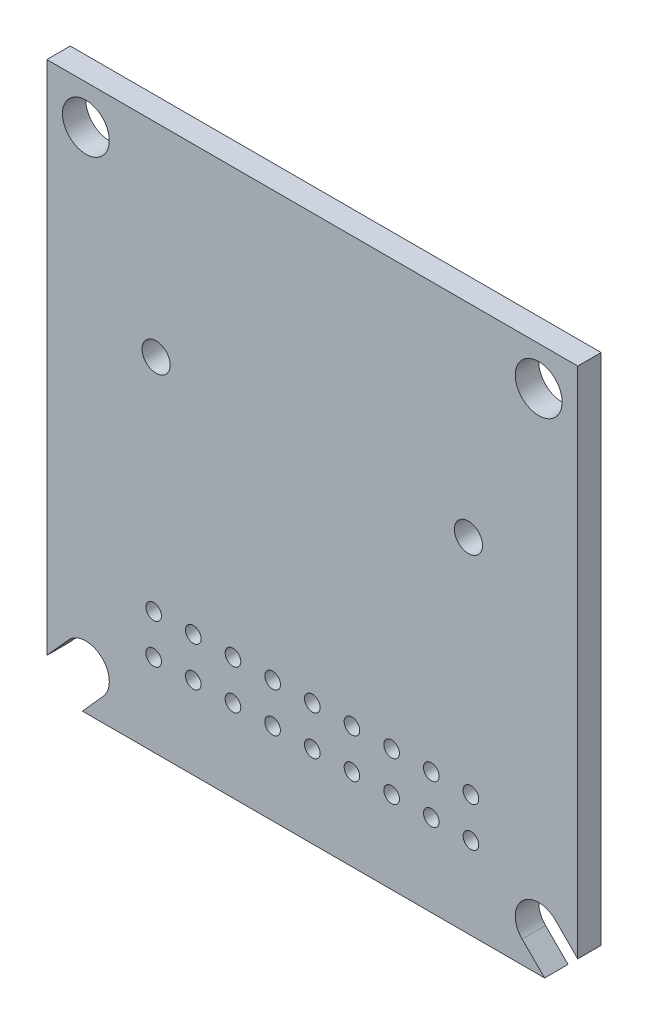
ISO-10303-21;
HEADER;
FILE_DESCRIPTION(('STEP AP214'),'2;1');
FILE_NAME('part.step','',(''),(''),'','','');
FILE_SCHEMA(('AUTOMOTIVE_DESIGN { 1 0 10303 214 1 1 1 1 }'));
ENDSEC;
DATA;
#1=APPLICATION_CONTEXT('core data for automotive mechanical design processes');
#2=APPLICATION_PROTOCOL_DEFINITION('international standard','automotive_design',2000,#1);
#3=PRODUCT_CONTEXT('',#1,'mechanical');
#4=PRODUCT('Part','Part','',(#3));
#5=PRODUCT_RELATED_PRODUCT_CATEGORY('part','',(#4));
#6=PRODUCT_DEFINITION_FORMATION('','',#4);
#7=PRODUCT_DEFINITION_CONTEXT('part definition',#1,'design');
#8=PRODUCT_DEFINITION('design','',#6,#7);
#9=PRODUCT_DEFINITION_SHAPE('','',#8);
#10=(LENGTH_UNIT() NAMED_UNIT(*) SI_UNIT(.MILLI.,.METRE.));
#11=(NAMED_UNIT(*) PLANE_ANGLE_UNIT() SI_UNIT($,.RADIAN.));
#12=(NAMED_UNIT(*) SI_UNIT($,.STERADIAN.) SOLID_ANGLE_UNIT());
#13=UNCERTAINTY_MEASURE_WITH_UNIT(LENGTH_MEASURE(1.E-05),#10,'distance_accuracy_value','');
#14=(GEOMETRIC_REPRESENTATION_CONTEXT(3) GLOBAL_UNCERTAINTY_ASSIGNED_CONTEXT((#13)) GLOBAL_UNIT_ASSIGNED_CONTEXT((#10,
#11,#12)) REPRESENTATION_CONTEXT('',''));
#15=CARTESIAN_POINT('',(0.,0.,0.));
#16=DIRECTION('',(0.,0.,1.));
#17=DIRECTION('',(1.,0.,0.));
#18=AXIS2_PLACEMENT_3D('',#15,#16,#17);
#19=CARTESIAN_POINT('',(0.,0.,0.));
#20=DIRECTION('',(0.,0.,1.));
#21=DIRECTION('',(1.,0.,0.));
#22=AXIS2_PLACEMENT_3D('',#19,#20,#21);
#23=PLANE('',#22);
#24=CARTESIAN_POINT('',(14.5,15.,0.));
#25=DIRECTION('',(0.,0.,-1.));
#26=DIRECTION('',(-1.,0.,0.));
#27=AXIS2_PLACEMENT_3D('',#24,#25,#26);
#28=CIRCLE('',#27,1.5);
#29=CARTESIAN_POINT('',(13.,15.,0.));
#30=VERTEX_POINT('',#29);
#31=EDGE_CURVE('E234',#30,#30,#28,.F.);
#32=ORIENTED_EDGE('',*,*,#31,.T.);
#33=EDGE_LOOP('',(#32));
#34=FACE_BOUND('',#33,.T.);
#35=CARTESIAN_POINT('',(-14.5,15.,0.));
#36=DIRECTION('',(0.,0.,-1.));
#37=DIRECTION('',(-1.,0.,0.));
#38=AXIS2_PLACEMENT_3D('',#35,#36,#37);
#39=CIRCLE('',#38,1.5);
#40=CARTESIAN_POINT('',(-16.,15.,0.));
#41=VERTEX_POINT('',#40);
#42=EDGE_CURVE('E242',#41,#41,#39,.F.);
#43=ORIENTED_EDGE('',*,*,#42,.T.);
#44=EDGE_LOOP('',(#43));
#45=FACE_BOUND('',#44,.T.);
#46=CARTESIAN_POINT('',(10.,4.5,0.));
#47=DIRECTION('',(0.,0.,-1.));
#48=DIRECTION('',(-1.,0.,0.));
#49=AXIS2_PLACEMENT_3D('',#46,#47,#48);
#50=CIRCLE('',#49,0.9);
#51=CARTESIAN_POINT('',(9.1,4.5,0.));
#52=VERTEX_POINT('',#51);
#53=EDGE_CURVE('E251',#52,#52,#50,.F.);
#54=ORIENTED_EDGE('',*,*,#53,.T.);
#55=EDGE_LOOP('',(#54));
#56=FACE_BOUND('',#55,.T.);
#57=CARTESIAN_POINT('',(0.,-12.23,0.));
#58=DIRECTION('',(0.,0.,-1.));
#59=DIRECTION('',(-1.,0.,0.));
#60=AXIS2_PLACEMENT_3D('',#57,#58,#59);
#61=CIRCLE('',#60,0.500000000000001);
#62=CARTESIAN_POINT('',(-0.500000000000004,-12.23,0.));
#63=VERTEX_POINT('',#62);
#64=EDGE_CURVE('E255',#63,#63,#61,.F.);
#65=ORIENTED_EDGE('',*,*,#64,.T.);
#66=EDGE_LOOP('',(#65));
#67=FACE_BOUND('',#66,.T.);
#68=CARTESIAN_POINT('',(0.,-9.69000000000001,0.));
#69=DIRECTION('',(0.,0.,-1.));
#70=DIRECTION('',(-1.,0.,0.));
#71=AXIS2_PLACEMENT_3D('',#68,#69,#70);
#72=CIRCLE('',#71,0.500000000000001);
#73=CARTESIAN_POINT('',(-0.500000000000004,-9.69000000000001,0.));
#74=VERTEX_POINT('',#73);
#75=EDGE_CURVE('E259',#74,#74,#72,.F.);
#76=ORIENTED_EDGE('',*,*,#75,.T.);
#77=EDGE_LOOP('',(#76));
#78=FACE_BOUND('',#77,.T.);
#79=CARTESIAN_POINT('',(5.08,-12.23,0.));
#80=DIRECTION('',(0.,0.,-1.));
#81=DIRECTION('',(-1.,0.,0.));
#82=AXIS2_PLACEMENT_3D('',#79,#80,#81);
#83=CIRCLE('',#82,0.5);
#84=CARTESIAN_POINT('',(4.58,-12.23,0.));
#85=VERTEX_POINT('',#84);
#86=EDGE_CURVE('E263',#85,#85,#83,.F.);
#87=ORIENTED_EDGE('',*,*,#86,.T.);
#88=EDGE_LOOP('',(#87));
#89=FACE_BOUND('',#88,.T.);
#90=CARTESIAN_POINT('',(2.54,-9.69000000000001,0.));
#91=DIRECTION('',(0.,0.,-1.));
#92=DIRECTION('',(-1.,0.,0.));
#93=AXIS2_PLACEMENT_3D('',#90,#91,#92);
#94=CIRCLE('',#93,0.500000000000001);
#95=CARTESIAN_POINT('',(2.04,-9.69000000000001,0.));
#96=VERTEX_POINT('',#95);
#97=EDGE_CURVE('E267',#96,#96,#94,.F.);
#98=ORIENTED_EDGE('',*,*,#97,.T.);
#99=EDGE_LOOP('',(#98));
#100=FACE_BOUND('',#99,.T.);
#101=CARTESIAN_POINT('',(2.54,-12.23,0.));
#102=DIRECTION('',(0.,0.,-1.));
#103=DIRECTION('',(-1.,0.,0.));
#104=AXIS2_PLACEMENT_3D('',#101,#102,#103);
#105=CIRCLE('',#104,0.500000000000001);
#106=CARTESIAN_POINT('',(2.04,-12.23,0.));
#107=VERTEX_POINT('',#106);
#108=EDGE_CURVE('E271',#107,#107,#105,.F.);
#109=ORIENTED_EDGE('',*,*,#108,.T.);
#110=EDGE_LOOP('',(#109));
#111=FACE_BOUND('',#110,.T.);
#112=CARTESIAN_POINT('',(10.16,-9.69000000000001,0.));
#113=DIRECTION('',(0.,0.,-1.));
#114=DIRECTION('',(-1.,0.,0.));
#115=AXIS2_PLACEMENT_3D('',#112,#113,#114);
#116=CIRCLE('',#115,0.5);
#117=CARTESIAN_POINT('',(9.66,-9.69000000000001,0.));
#118=VERTEX_POINT('',#117);
#119=EDGE_CURVE('E275',#118,#118,#116,.F.);
#120=ORIENTED_EDGE('',*,*,#119,.T.);
#121=EDGE_LOOP('',(#120));
#122=FACE_BOUND('',#121,.T.);
#123=CARTESIAN_POINT('',(10.16,-12.23,0.));
#124=DIRECTION('',(0.,0.,-1.));
#125=DIRECTION('',(-1.,0.,0.));
#126=AXIS2_PLACEMENT_3D('',#123,#124,#125);
#127=CIRCLE('',#126,0.5);
#128=CARTESIAN_POINT('',(9.66,-12.23,0.));
#129=VERTEX_POINT('',#128);
#130=EDGE_CURVE('E279',#129,#129,#127,.F.);
#131=ORIENTED_EDGE('',*,*,#130,.T.);
#132=EDGE_LOOP('',(#131));
#133=FACE_BOUND('',#132,.T.);
#134=CARTESIAN_POINT('',(7.62,-9.69000000000001,0.));
#135=DIRECTION('',(0.,0.,-1.));
#136=DIRECTION('',(-1.,0.,0.));
#137=AXIS2_PLACEMENT_3D('',#134,#135,#136);
#138=CIRCLE('',#137,0.5);
#139=CARTESIAN_POINT('',(7.12,-9.69000000000001,0.));
#140=VERTEX_POINT('',#139);
#141=EDGE_CURVE('E283',#140,#140,#138,.F.);
#142=ORIENTED_EDGE('',*,*,#141,.T.);
#143=EDGE_LOOP('',(#142));
#144=FACE_BOUND('',#143,.T.);
#145=CARTESIAN_POINT('',(7.62,-12.23,0.));
#146=DIRECTION('',(0.,0.,-1.));
#147=DIRECTION('',(-1.,0.,0.));
#148=AXIS2_PLACEMENT_3D('',#145,#146,#147);
#149=CIRCLE('',#148,0.5);
#150=CARTESIAN_POINT('',(7.12,-12.23,0.));
#151=VERTEX_POINT('',#150);
#152=EDGE_CURVE('E287',#151,#151,#149,.F.);
#153=ORIENTED_EDGE('',*,*,#152,.T.);
#154=EDGE_LOOP('',(#153));
#155=FACE_BOUND('',#154,.T.);
#156=CARTESIAN_POINT('',(5.08,-9.69000000000001,0.));
#157=DIRECTION('',(0.,0.,-1.));
#158=DIRECTION('',(-1.,0.,0.));
#159=AXIS2_PLACEMENT_3D('',#156,#157,#158);
#160=CIRCLE('',#159,0.5);
#161=CARTESIAN_POINT('',(4.58,-9.69000000000001,0.));
#162=VERTEX_POINT('',#161);
#163=EDGE_CURVE('E291',#162,#162,#160,.F.);
#164=ORIENTED_EDGE('',*,*,#163,.T.);
#165=EDGE_LOOP('',(#164));
#166=FACE_BOUND('',#165,.T.);
#167=CARTESIAN_POINT('',(-7.62,-12.23,0.));
#168=DIRECTION('',(0.,0.,-1.));
#169=DIRECTION('',(-1.,0.,0.));
#170=AXIS2_PLACEMENT_3D('',#167,#168,#169);
#171=CIRCLE('',#170,0.5);
#172=CARTESIAN_POINT('',(-8.12,-12.23,0.));
#173=VERTEX_POINT('',#172);
#174=EDGE_CURVE('E295',#173,#173,#171,.F.);
#175=ORIENTED_EDGE('',*,*,#174,.T.);
#176=EDGE_LOOP('',(#175));
#177=FACE_BOUND('',#176,.T.);
#178=CARTESIAN_POINT('',(-10.16,-9.69000000000001,0.));
#179=DIRECTION('',(0.,0.,-1.));
#180=DIRECTION('',(-1.,0.,0.));
#181=AXIS2_PLACEMENT_3D('',#178,#179,#180);
#182=CIRCLE('',#181,0.5);
#183=CARTESIAN_POINT('',(-10.66,-9.69000000000001,0.));
#184=VERTEX_POINT('',#183);
#185=EDGE_CURVE('E299',#184,#184,#182,.F.);
#186=ORIENTED_EDGE('',*,*,#185,.T.);
#187=EDGE_LOOP('',(#186));
#188=FACE_BOUND('',#187,.T.);
#189=CARTESIAN_POINT('',(-10.16,-12.23,0.));
#190=DIRECTION('',(0.,0.,-1.));
#191=DIRECTION('',(-1.,0.,0.));
#192=AXIS2_PLACEMENT_3D('',#189,#190,#191);
#193=CIRCLE('',#192,0.5);
#194=CARTESIAN_POINT('',(-10.66,-12.23,0.));
#195=VERTEX_POINT('',#194);
#196=EDGE_CURVE('E303',#195,#195,#193,.F.);
#197=ORIENTED_EDGE('',*,*,#196,.T.);
#198=EDGE_LOOP('',(#197));
#199=FACE_BOUND('',#198,.T.);
#200=CARTESIAN_POINT('',(-10.,4.5,0.));
#201=DIRECTION('',(0.,0.,-1.));
#202=DIRECTION('',(-1.,0.,0.));
#203=AXIS2_PLACEMENT_3D('',#200,#201,#202);
#204=CIRCLE('',#203,0.9);
#205=CARTESIAN_POINT('',(-10.9,4.5,0.));
#206=VERTEX_POINT('',#205);
#207=EDGE_CURVE('E307',#206,#206,#204,.F.);
#208=ORIENTED_EDGE('',*,*,#207,.T.);
#209=EDGE_LOOP('',(#208));
#210=FACE_BOUND('',#209,.T.);
#211=CARTESIAN_POINT('',(-2.54,-9.69000000000001,0.));
#212=DIRECTION('',(0.,0.,-1.));
#213=DIRECTION('',(-1.,0.,0.));
#214=AXIS2_PLACEMENT_3D('',#211,#212,#213);
#215=CIRCLE('',#214,0.500000000000001);
#216=CARTESIAN_POINT('',(-3.04,-9.69000000000001,0.));
#217=VERTEX_POINT('',#216);
#218=EDGE_CURVE('E311',#217,#217,#215,.F.);
#219=ORIENTED_EDGE('',*,*,#218,.T.);
#220=EDGE_LOOP('',(#219));
#221=FACE_BOUND('',#220,.T.);
#222=CARTESIAN_POINT('',(-2.54,-12.23,0.));
#223=DIRECTION('',(0.,0.,-1.));
#224=DIRECTION('',(-1.,0.,0.));
#225=AXIS2_PLACEMENT_3D('',#222,#223,#224);
#226=CIRCLE('',#225,0.500000000000001);
#227=CARTESIAN_POINT('',(-3.04,-12.23,0.));
#228=VERTEX_POINT('',#227);
#229=EDGE_CURVE('E315',#228,#228,#226,.F.);
#230=ORIENTED_EDGE('',*,*,#229,.T.);
#231=EDGE_LOOP('',(#230));
#232=FACE_BOUND('',#231,.T.);
#233=CARTESIAN_POINT('',(-5.08,-9.69000000000001,0.));
#234=DIRECTION('',(0.,0.,-1.));
#235=DIRECTION('',(-1.,0.,0.));
#236=AXIS2_PLACEMENT_3D('',#233,#234,#235);
#237=CIRCLE('',#236,0.500000000000001);
#238=CARTESIAN_POINT('',(-5.58000000000001,-9.69000000000001,0.));
#239=VERTEX_POINT('',#238);
#240=EDGE_CURVE('E319',#239,#239,#237,.F.);
#241=ORIENTED_EDGE('',*,*,#240,.T.);
#242=EDGE_LOOP('',(#241));
#243=FACE_BOUND('',#242,.T.);
#244=CARTESIAN_POINT('',(-5.08,-12.23,0.));
#245=DIRECTION('',(0.,0.,-1.));
#246=DIRECTION('',(-1.,0.,0.));
#247=AXIS2_PLACEMENT_3D('',#244,#245,#246);
#248=CIRCLE('',#247,0.500000000000001);
#249=CARTESIAN_POINT('',(-5.58000000000001,-12.23,0.));
#250=VERTEX_POINT('',#249);
#251=EDGE_CURVE('E323',#250,#250,#248,.F.);
#252=ORIENTED_EDGE('',*,*,#251,.T.);
#253=EDGE_LOOP('',(#252));
#254=FACE_BOUND('',#253,.T.);
#255=CARTESIAN_POINT('',(-7.62,-9.69000000000001,0.));
#256=DIRECTION('',(0.,0.,-1.));
#257=DIRECTION('',(-1.,0.,0.));
#258=AXIS2_PLACEMENT_3D('',#255,#256,#257);
#259=CIRCLE('',#258,0.5);
#260=CARTESIAN_POINT('',(-8.12,-9.69000000000001,0.));
#261=VERTEX_POINT('',#260);
#262=EDGE_CURVE('E327',#261,#261,#259,.F.);
#263=ORIENTED_EDGE('',*,*,#262,.T.);
#264=EDGE_LOOP('',(#263));
#265=FACE_BOUND('',#264,.T.);
#266=DIRECTION('',(-0.666000580325846,-0.74595122293997,0.));
#267=VECTOR('',#266,1.);
#268=CARTESIAN_POINT('',(0.502559253420135,-0.448695228498699,0.));
#269=LINE('',#268,#267);
#270=CARTESIAN_POINT('',(-13.38107316559,-15.9990008704888,0.));
#271=VERTEX_POINT('',#270);
#272=CARTESIAN_POINT('',(-14.7211960323147,-17.5,0.));
#273=VERTEX_POINT('',#272);
#274=EDGE_CURVE('E416',#271,#273,#269,.T.);
#275=ORIENTED_EDGE('',*,*,#274,.F.);
#276=CARTESIAN_POINT('',(-14.5,-15.,0.));
#277=DIRECTION('',(0.,0.,-1.));
#278=DIRECTION('',(-1.,0.,0.));
#279=AXIS2_PLACEMENT_3D('',#276,#277,#278);
#280=CIRCLE('',#279,1.5);
#281=CARTESIAN_POINT('',(-15.61892683441,-14.0009991295112,0.));
#282=VERTEX_POINT('',#281);
#283=EDGE_CURVE('E238',#271,#282,#280,.F.);
#284=ORIENTED_EDGE('',*,*,#283,.T.);
#285=DIRECTION('',(-0.666000580325846,-0.74595122293997,0.));
#286=VECTOR('',#285,1.);
#287=CARTESIAN_POINT('',(-1.73529441539978,1.54930651247884,0.));
#288=LINE('',#287,#286);
#289=CARTESIAN_POINT('',(-17.,-15.5478644735886,0.));
#290=VERTEX_POINT('',#289);
#291=EDGE_CURVE('E55',#282,#290,#288,.T.);
#292=ORIENTED_EDGE('',*,*,#291,.T.);
#293=DIRECTION('',(0.,1.,0.));
#294=VECTOR('',#293,1.);
#295=CARTESIAN_POINT('',(-17.,-17.5,0.));
#296=LINE('',#295,#294);
#297=CARTESIAN_POINT('',(-17.,17.5,0.));
#298=VERTEX_POINT('',#297);
#299=EDGE_CURVE('E246',#290,#298,#296,.T.);
#300=ORIENTED_EDGE('',*,*,#299,.T.);
#301=DIRECTION('',(1.,0.,0.));
#302=VECTOR('',#301,1.);
#303=CARTESIAN_POINT('',(17.,17.5,0.));
#304=LINE('',#303,#302);
#305=CARTESIAN_POINT('',(17.,17.5,0.));
#306=VERTEX_POINT('',#305);
#307=EDGE_CURVE('E241',#298,#306,#304,.T.);
#308=ORIENTED_EDGE('',*,*,#307,.T.);
#309=DIRECTION('',(0.,1.,0.));
#310=VECTOR('',#309,1.);
#311=CARTESIAN_POINT('',(17.,-17.5,0.));
#312=LINE('',#311,#310);
#313=CARTESIAN_POINT('',(17.,-15.3786796564404,0.));
#314=VERTEX_POINT('',#313);
#315=EDGE_CURVE('E364',#306,#314,#312,.F.);
#316=ORIENTED_EDGE('',*,*,#315,.T.);
#317=DIRECTION('',(0.707106781186546,-0.707106781186549,0.));
#318=VECTOR('',#317,1.);
#319=CARTESIAN_POINT('',(0.810660171779854,0.810660171779851,0.));
#320=LINE('',#319,#318);
#321=CARTESIAN_POINT('',(15.5606601717798,-13.9393398282202,0.));
#322=VERTEX_POINT('',#321);
#323=EDGE_CURVE('E330',#322,#314,#320,.T.);
#324=ORIENTED_EDGE('',*,*,#323,.F.);
#325=CARTESIAN_POINT('',(14.5,-15.,0.));
#326=DIRECTION('',(0.,0.,-1.));
#327=DIRECTION('',(-1.,0.,0.));
#328=AXIS2_PLACEMENT_3D('',#325,#326,#327);
#329=CIRCLE('',#328,1.5);
#330=CARTESIAN_POINT('',(13.4393398282202,-16.0606601717798,0.));
#331=VERTEX_POINT('',#330);
#332=EDGE_CURVE('E247',#322,#331,#329,.F.);
#333=ORIENTED_EDGE('',*,*,#332,.T.);
#334=DIRECTION('',(0.707106781186546,-0.707106781186549,0.));
#335=VECTOR('',#334,1.);
#336=CARTESIAN_POINT('',(-1.31066017177979,-1.31066017177979,0.));
#337=LINE('',#336,#335);
#338=CARTESIAN_POINT('',(14.8786796564404,-17.5,0.));
#339=VERTEX_POINT('',#338);
#340=EDGE_CURVE('E334',#331,#339,#337,.T.);
#341=ORIENTED_EDGE('',*,*,#340,.T.);
#342=DIRECTION('',(-1.,0.,0.));
#343=VECTOR('',#342,1.);
#344=CARTESIAN_POINT('',(17.,-17.5,0.));
#345=LINE('',#344,#343);
#346=EDGE_CURVE('E368',#339,#273,#345,.T.);
#347=ORIENTED_EDGE('',*,*,#346,.T.);
#348=EDGE_LOOP('',(#275,#284,#292,#300,#308,#316,#324,#333,#341,#347));
#349=FACE_BOUND('',#348,.T.);
#350=ADVANCED_FACE('F40',(#34,#45,#56,#67,#78,#89,#100,#111,#122,#133,#144,#155,#166,#177,#188,
#199,#210,#221,#232,#243,#254,#265,#349),#23,.F.);
#351=CARTESIAN_POINT('',(0.,0.,1.5));
#352=DIRECTION('',(0.,0.,1.));
#353=DIRECTION('',(1.,0.,0.));
#354=AXIS2_PLACEMENT_3D('',#351,#352,#353);
#355=PLANE('',#354);
#356=CARTESIAN_POINT('',(14.5,15.,1.5));
#357=DIRECTION('',(0.,0.,-1.));
#358=DIRECTION('',(-1.,0.,0.));
#359=AXIS2_PLACEMENT_3D('',#356,#357,#358);
#360=CIRCLE('',#359,1.5);
#361=CARTESIAN_POINT('',(13.,15.,1.5));
#362=VERTEX_POINT('',#361);
#363=EDGE_CURVE('E122',#362,#362,#360,.T.);
#364=ORIENTED_EDGE('',*,*,#363,.T.);
#365=EDGE_LOOP('',(#364));
#366=FACE_BOUND('',#365,.T.);
#367=CARTESIAN_POINT('',(-14.5,15.,1.5));
#368=DIRECTION('',(0.,0.,-1.));
#369=DIRECTION('',(-1.,0.,0.));
#370=AXIS2_PLACEMENT_3D('',#367,#368,#369);
#371=CIRCLE('',#370,1.5);
#372=CARTESIAN_POINT('',(-16.,15.,1.5));
#373=VERTEX_POINT('',#372);
#374=EDGE_CURVE('E147',#373,#373,#371,.T.);
#375=ORIENTED_EDGE('',*,*,#374,.T.);
#376=EDGE_LOOP('',(#375));
#377=FACE_BOUND('',#376,.T.);
#378=CARTESIAN_POINT('',(10.,4.5,1.5));
#379=DIRECTION('',(0.,0.,-1.));
#380=DIRECTION('',(-1.,0.,0.));
#381=AXIS2_PLACEMENT_3D('',#378,#379,#380);
#382=CIRCLE('',#381,0.9);
#383=CARTESIAN_POINT('',(9.1,4.5,1.5));
#384=VERTEX_POINT('',#383);
#385=EDGE_CURVE('E155',#384,#384,#382,.T.);
#386=ORIENTED_EDGE('',*,*,#385,.T.);
#387=EDGE_LOOP('',(#386));
#388=FACE_BOUND('',#387,.T.);
#389=CARTESIAN_POINT('',(0.,-12.23,1.5));
#390=DIRECTION('',(0.,0.,-1.));
#391=DIRECTION('',(-1.,0.,0.));
#392=AXIS2_PLACEMENT_3D('',#389,#390,#391);
#393=CIRCLE('',#392,0.500000000000001);
#394=CARTESIAN_POINT('',(-0.500000000000004,-12.23,1.5));
#395=VERTEX_POINT('',#394);
#396=EDGE_CURVE('E159',#395,#395,#393,.T.);
#397=ORIENTED_EDGE('',*,*,#396,.T.);
#398=EDGE_LOOP('',(#397));
#399=FACE_BOUND('',#398,.T.);
#400=CARTESIAN_POINT('',(0.,-9.69000000000001,1.5));
#401=DIRECTION('',(0.,0.,-1.));
#402=DIRECTION('',(-1.,0.,0.));
#403=AXIS2_PLACEMENT_3D('',#400,#401,#402);
#404=CIRCLE('',#403,0.500000000000001);
#405=CARTESIAN_POINT('',(-0.500000000000004,-9.69000000000001,1.5));
#406=VERTEX_POINT('',#405);
#407=EDGE_CURVE('E163',#406,#406,#404,.T.);
#408=ORIENTED_EDGE('',*,*,#407,.T.);
#409=EDGE_LOOP('',(#408));
#410=FACE_BOUND('',#409,.T.);
#411=CARTESIAN_POINT('',(5.08,-12.23,1.5));
#412=DIRECTION('',(0.,0.,-1.));
#413=DIRECTION('',(-1.,0.,0.));
#414=AXIS2_PLACEMENT_3D('',#411,#412,#413);
#415=CIRCLE('',#414,0.5);
#416=CARTESIAN_POINT('',(4.58,-12.23,1.5));
#417=VERTEX_POINT('',#416);
#418=EDGE_CURVE('E167',#417,#417,#415,.T.);
#419=ORIENTED_EDGE('',*,*,#418,.T.);
#420=EDGE_LOOP('',(#419));
#421=FACE_BOUND('',#420,.T.);
#422=CARTESIAN_POINT('',(2.54,-9.69000000000001,1.5));
#423=DIRECTION('',(0.,0.,-1.));
#424=DIRECTION('',(-1.,0.,0.));
#425=AXIS2_PLACEMENT_3D('',#422,#423,#424);
#426=CIRCLE('',#425,0.500000000000001);
#427=CARTESIAN_POINT('',(2.04,-9.69000000000001,1.5));
#428=VERTEX_POINT('',#427);
#429=EDGE_CURVE('E171',#428,#428,#426,.T.);
#430=ORIENTED_EDGE('',*,*,#429,.T.);
#431=EDGE_LOOP('',(#430));
#432=FACE_BOUND('',#431,.T.);
#433=CARTESIAN_POINT('',(2.54,-12.23,1.5));
#434=DIRECTION('',(0.,0.,-1.));
#435=DIRECTION('',(-1.,0.,0.));
#436=AXIS2_PLACEMENT_3D('',#433,#434,#435);
#437=CIRCLE('',#436,0.500000000000001);
#438=CARTESIAN_POINT('',(2.04,-12.23,1.5));
#439=VERTEX_POINT('',#438);
#440=EDGE_CURVE('E175',#439,#439,#437,.T.);
#441=ORIENTED_EDGE('',*,*,#440,.T.);
#442=EDGE_LOOP('',(#441));
#443=FACE_BOUND('',#442,.T.);
#444=CARTESIAN_POINT('',(10.16,-9.69000000000001,1.5));
#445=DIRECTION('',(0.,0.,-1.));
#446=DIRECTION('',(-1.,0.,0.));
#447=AXIS2_PLACEMENT_3D('',#444,#445,#446);
#448=CIRCLE('',#447,0.5);
#449=CARTESIAN_POINT('',(9.66,-9.69000000000001,1.5));
#450=VERTEX_POINT('',#449);
#451=EDGE_CURVE('E179',#450,#450,#448,.T.);
#452=ORIENTED_EDGE('',*,*,#451,.T.);
#453=EDGE_LOOP('',(#452));
#454=FACE_BOUND('',#453,.T.);
#455=CARTESIAN_POINT('',(10.16,-12.23,1.5));
#456=DIRECTION('',(0.,0.,-1.));
#457=DIRECTION('',(-1.,0.,0.));
#458=AXIS2_PLACEMENT_3D('',#455,#456,#457);
#459=CIRCLE('',#458,0.5);
#460=CARTESIAN_POINT('',(9.66,-12.23,1.5));
#461=VERTEX_POINT('',#460);
#462=EDGE_CURVE('E183',#461,#461,#459,.T.);
#463=ORIENTED_EDGE('',*,*,#462,.T.);
#464=EDGE_LOOP('',(#463));
#465=FACE_BOUND('',#464,.T.);
#466=CARTESIAN_POINT('',(7.62,-9.69000000000001,1.5));
#467=DIRECTION('',(0.,0.,-1.));
#468=DIRECTION('',(-1.,0.,0.));
#469=AXIS2_PLACEMENT_3D('',#466,#467,#468);
#470=CIRCLE('',#469,0.5);
#471=CARTESIAN_POINT('',(7.12,-9.69000000000001,1.5));
#472=VERTEX_POINT('',#471);
#473=EDGE_CURVE('E187',#472,#472,#470,.T.);
#474=ORIENTED_EDGE('',*,*,#473,.T.);
#475=EDGE_LOOP('',(#474));
#476=FACE_BOUND('',#475,.T.);
#477=CARTESIAN_POINT('',(7.62,-12.23,1.5));
#478=DIRECTION('',(0.,0.,-1.));
#479=DIRECTION('',(-1.,0.,0.));
#480=AXIS2_PLACEMENT_3D('',#477,#478,#479);
#481=CIRCLE('',#480,0.5);
#482=CARTESIAN_POINT('',(7.12,-12.23,1.5));
#483=VERTEX_POINT('',#482);
#484=EDGE_CURVE('E191',#483,#483,#481,.T.);
#485=ORIENTED_EDGE('',*,*,#484,.T.);
#486=EDGE_LOOP('',(#485));
#487=FACE_BOUND('',#486,.T.);
#488=CARTESIAN_POINT('',(5.08,-9.69000000000001,1.5));
#489=DIRECTION('',(0.,0.,-1.));
#490=DIRECTION('',(-1.,0.,0.));
#491=AXIS2_PLACEMENT_3D('',#488,#489,#490);
#492=CIRCLE('',#491,0.5);
#493=CARTESIAN_POINT('',(4.58,-9.69000000000001,1.5));
#494=VERTEX_POINT('',#493);
#495=EDGE_CURVE('E195',#494,#494,#492,.T.);
#496=ORIENTED_EDGE('',*,*,#495,.T.);
#497=EDGE_LOOP('',(#496));
#498=FACE_BOUND('',#497,.T.);
#499=CARTESIAN_POINT('',(-7.62,-12.23,1.5));
#500=DIRECTION('',(0.,0.,-1.));
#501=DIRECTION('',(-1.,0.,0.));
#502=AXIS2_PLACEMENT_3D('',#499,#500,#501);
#503=CIRCLE('',#502,0.5);
#504=CARTESIAN_POINT('',(-8.12,-12.23,1.5));
#505=VERTEX_POINT('',#504);
#506=EDGE_CURVE('E198',#505,#505,#503,.T.);
#507=ORIENTED_EDGE('',*,*,#506,.T.);
#508=EDGE_LOOP('',(#507));
#509=FACE_BOUND('',#508,.T.);
#510=CARTESIAN_POINT('',(-10.16,-9.69000000000001,1.5));
#511=DIRECTION('',(0.,0.,-1.));
#512=DIRECTION('',(-1.,0.,0.));
#513=AXIS2_PLACEMENT_3D('',#510,#511,#512);
#514=CIRCLE('',#513,0.5);
#515=CARTESIAN_POINT('',(-10.66,-9.69000000000001,1.5));
#516=VERTEX_POINT('',#515);
#517=EDGE_CURVE('E202',#516,#516,#514,.T.);
#518=ORIENTED_EDGE('',*,*,#517,.T.);
#519=EDGE_LOOP('',(#518));
#520=FACE_BOUND('',#519,.T.);
#521=CARTESIAN_POINT('',(-10.16,-12.23,1.5));
#522=DIRECTION('',(0.,0.,-1.));
#523=DIRECTION('',(-1.,0.,0.));
#524=AXIS2_PLACEMENT_3D('',#521,#522,#523);
#525=CIRCLE('',#524,0.5);
#526=CARTESIAN_POINT('',(-10.66,-12.23,1.5));
#527=VERTEX_POINT('',#526);
#528=EDGE_CURVE('E206',#527,#527,#525,.T.);
#529=ORIENTED_EDGE('',*,*,#528,.T.);
#530=EDGE_LOOP('',(#529));
#531=FACE_BOUND('',#530,.T.);
#532=CARTESIAN_POINT('',(-10.,4.5,1.5));
#533=DIRECTION('',(0.,0.,-1.));
#534=DIRECTION('',(-1.,0.,0.));
#535=AXIS2_PLACEMENT_3D('',#532,#533,#534);
#536=CIRCLE('',#535,0.9);
#537=CARTESIAN_POINT('',(-10.9,4.5,1.5));
#538=VERTEX_POINT('',#537);
#539=EDGE_CURVE('E210',#538,#538,#536,.T.);
#540=ORIENTED_EDGE('',*,*,#539,.T.);
#541=EDGE_LOOP('',(#540));
#542=FACE_BOUND('',#541,.T.);
#543=CARTESIAN_POINT('',(-2.54,-9.69000000000001,1.5));
#544=DIRECTION('',(0.,0.,-1.));
#545=DIRECTION('',(-1.,0.,0.));
#546=AXIS2_PLACEMENT_3D('',#543,#544,#545);
#547=CIRCLE('',#546,0.500000000000001);
#548=CARTESIAN_POINT('',(-3.04,-9.69000000000001,1.5));
#549=VERTEX_POINT('',#548);
#550=EDGE_CURVE('E214',#549,#549,#547,.T.);
#551=ORIENTED_EDGE('',*,*,#550,.T.);
#552=EDGE_LOOP('',(#551));
#553=FACE_BOUND('',#552,.T.);
#554=CARTESIAN_POINT('',(-2.54,-12.23,1.5));
#555=DIRECTION('',(0.,0.,-1.));
#556=DIRECTION('',(-1.,0.,0.));
#557=AXIS2_PLACEMENT_3D('',#554,#555,#556);
#558=CIRCLE('',#557,0.500000000000001);
#559=CARTESIAN_POINT('',(-3.04,-12.23,1.5));
#560=VERTEX_POINT('',#559);
#561=EDGE_CURVE('E218',#560,#560,#558,.T.);
#562=ORIENTED_EDGE('',*,*,#561,.T.);
#563=EDGE_LOOP('',(#562));
#564=FACE_BOUND('',#563,.T.);
#565=CARTESIAN_POINT('',(-5.08,-9.69000000000001,1.5));
#566=DIRECTION('',(0.,0.,-1.));
#567=DIRECTION('',(-1.,0.,0.));
#568=AXIS2_PLACEMENT_3D('',#565,#566,#567);
#569=CIRCLE('',#568,0.500000000000001);
#570=CARTESIAN_POINT('',(-5.58000000000001,-9.69000000000001,1.5));
#571=VERTEX_POINT('',#570);
#572=EDGE_CURVE('E222',#571,#571,#569,.T.);
#573=ORIENTED_EDGE('',*,*,#572,.T.);
#574=EDGE_LOOP('',(#573));
#575=FACE_BOUND('',#574,.T.);
#576=CARTESIAN_POINT('',(-5.08,-12.23,1.5));
#577=DIRECTION('',(0.,0.,-1.));
#578=DIRECTION('',(-1.,0.,0.));
#579=AXIS2_PLACEMENT_3D('',#576,#577,#578);
#580=CIRCLE('',#579,0.500000000000001);
#581=CARTESIAN_POINT('',(-5.58000000000001,-12.23,1.5));
#582=VERTEX_POINT('',#581);
#583=EDGE_CURVE('E226',#582,#582,#580,.T.);
#584=ORIENTED_EDGE('',*,*,#583,.T.);
#585=EDGE_LOOP('',(#584));
#586=FACE_BOUND('',#585,.T.);
#587=CARTESIAN_POINT('',(-7.62,-9.69000000000001,1.5));
#588=DIRECTION('',(0.,0.,-1.));
#589=DIRECTION('',(-1.,0.,0.));
#590=AXIS2_PLACEMENT_3D('',#587,#588,#589);
#591=CIRCLE('',#590,0.5);
#592=CARTESIAN_POINT('',(-8.12,-9.69000000000001,1.5));
#593=VERTEX_POINT('',#592);
#594=EDGE_CURVE('E230',#593,#593,#591,.T.);
#595=ORIENTED_EDGE('',*,*,#594,.T.);
#596=EDGE_LOOP('',(#595));
#597=FACE_BOUND('',#596,.T.);
#598=CARTESIAN_POINT('',(-14.5,-15.,1.5));
#599=DIRECTION('',(0.,0.,-1.));
#600=DIRECTION('',(-1.,0.,0.));
#601=AXIS2_PLACEMENT_3D('',#598,#599,#600);
#602=CIRCLE('',#601,1.5);
#603=CARTESIAN_POINT('',(-15.6189268344099,-14.0009991295112,1.5));
#604=VERTEX_POINT('',#603);
#605=CARTESIAN_POINT('',(-13.38107316559,-15.9990008704888,1.5));
#606=VERTEX_POINT('',#605);
#607=EDGE_CURVE('E127',#604,#606,#602,.T.);
#608=ORIENTED_EDGE('',*,*,#607,.T.);
#609=DIRECTION('',(-0.666000580325846,-0.74595122293997,0.));
#610=VECTOR('',#609,1.);
#611=CARTESIAN_POINT('',(0.502559253420135,-0.448695228498699,1.5));
#612=LINE('',#611,#610);
#613=CARTESIAN_POINT('',(-14.7211960323147,-17.5,1.5));
#614=VERTEX_POINT('',#613);
#615=EDGE_CURVE('E63',#606,#614,#612,.T.);
#616=ORIENTED_EDGE('',*,*,#615,.T.);
#617=DIRECTION('',(1.,0.,0.));
#618=VECTOR('',#617,1.);
#619=CARTESIAN_POINT('',(0.,-17.5,1.5));
#620=LINE('',#619,#618);
#621=CARTESIAN_POINT('',(14.8786796564404,-17.5,1.5));
#622=VERTEX_POINT('',#621);
#623=EDGE_CURVE('E348',#614,#622,#620,.T.);
#624=ORIENTED_EDGE('',*,*,#623,.T.);
#625=DIRECTION('',(0.707106781186546,-0.707106781186549,0.));
#626=VECTOR('',#625,1.);
#627=CARTESIAN_POINT('',(-1.31066017177979,-1.31066017177979,1.5));
#628=LINE('',#627,#626);
#629=CARTESIAN_POINT('',(13.4393398282202,-16.0606601717798,1.5));
#630=VERTEX_POINT('',#629);
#631=EDGE_CURVE('E406',#630,#622,#628,.T.);
#632=ORIENTED_EDGE('',*,*,#631,.F.);
#633=CARTESIAN_POINT('',(14.5,-15.,1.5));
#634=DIRECTION('',(0.,0.,-1.));
#635=DIRECTION('',(-1.,0.,0.));
#636=AXIS2_PLACEMENT_3D('',#633,#634,#635);
#637=CIRCLE('',#636,1.5);
#638=CARTESIAN_POINT('',(15.5606601717798,-13.9393398282202,1.5));
#639=VERTEX_POINT('',#638);
#640=EDGE_CURVE('E151',#630,#639,#637,.T.);
#641=ORIENTED_EDGE('',*,*,#640,.T.);
#642=DIRECTION('',(0.707106781186546,-0.707106781186549,0.));
#643=VECTOR('',#642,1.);
#644=CARTESIAN_POINT('',(0.810660171779854,0.810660171779851,1.5));
#645=LINE('',#644,#643);
#646=CARTESIAN_POINT('',(17.,-15.3786796564404,1.5));
#647=VERTEX_POINT('',#646);
#648=EDGE_CURVE('E412',#639,#647,#645,.T.);
#649=ORIENTED_EDGE('',*,*,#648,.T.);
#650=DIRECTION('',(0.,1.,0.));
#651=VECTOR('',#650,1.);
#652=CARTESIAN_POINT('',(17.,0.,1.5));
#653=LINE('',#652,#651);
#654=CARTESIAN_POINT('',(17.,17.5,1.5));
#655=VERTEX_POINT('',#654);
#656=EDGE_CURVE('E143',#647,#655,#653,.T.);
#657=ORIENTED_EDGE('',*,*,#656,.T.);
#658=DIRECTION('',(1.,0.,0.));
#659=VECTOR('',#658,1.);
#660=CARTESIAN_POINT('',(0.,17.5,1.5));
#661=LINE('',#660,#659);
#662=CARTESIAN_POINT('',(-17.,17.5,1.5));
#663=VERTEX_POINT('',#662);
#664=EDGE_CURVE('E135',#655,#663,#661,.F.);
#665=ORIENTED_EDGE('',*,*,#664,.T.);
#666=DIRECTION('',(0.,1.,0.));
#667=VECTOR('',#666,1.);
#668=CARTESIAN_POINT('',(-17.,0.,1.5));
#669=LINE('',#668,#667);
#670=CARTESIAN_POINT('',(-17.,-15.5478644735886,1.5));
#671=VERTEX_POINT('',#670);
#672=EDGE_CURVE('E129',#663,#671,#669,.F.);
#673=ORIENTED_EDGE('',*,*,#672,.T.);
#674=DIRECTION('',(-0.666000580325846,-0.74595122293997,0.));
#675=VECTOR('',#674,1.);
#676=CARTESIAN_POINT('',(-1.73529441539978,1.54930651247884,1.5));
#677=LINE('',#676,#675);
#678=EDGE_CURVE('E115',#604,#671,#677,.T.);
#679=ORIENTED_EDGE('',*,*,#678,.F.);
#680=EDGE_LOOP('',(#608,#616,#624,#632,#641,#649,#657,#665,#673,#679));
#681=FACE_BOUND('',#680,.T.);
#682=ADVANCED_FACE('F126',(#366,#377,#388,#399,#410,#421,#432,#443,#454,#465,#476,#487,#498,
#509,#520,#531,#542,#553,#564,#575,#586,#597,#681),#355,.T.);
#683=CARTESIAN_POINT('',(17.,-17.5,1.5));
#684=DIRECTION('',(0.,1.,0.));
#685=DIRECTION('',(-1.,0.,0.));
#686=AXIS2_PLACEMENT_3D('',#683,#684,#685);
#687=PLANE('',#686);
#688=DIRECTION('',(0.,0.,1.));
#689=VECTOR('',#688,1.);
#690=CARTESIAN_POINT('',(-14.7211960323147,-17.5,-8.5));
#691=LINE('',#690,#689);
#692=EDGE_CURVE('E420',#273,#614,#691,.T.);
#693=ORIENTED_EDGE('',*,*,#692,.F.);
#694=ORIENTED_EDGE('',*,*,#346,.F.);
#695=DIRECTION('',(0.,0.,1.));
#696=VECTOR('',#695,1.);
#697=CARTESIAN_POINT('',(14.8786796564404,-17.5,-8.5));
#698=LINE('',#697,#696);
#699=EDGE_CURVE('E399',#339,#622,#698,.T.);
#700=ORIENTED_EDGE('',*,*,#699,.T.);
#701=ORIENTED_EDGE('',*,*,#623,.F.);
#702=EDGE_LOOP('',(#693,#694,#700,#701));
#703=FACE_BOUND('',#702,.T.);
#704=ADVANCED_FACE('F426',(#703),#687,.F.);
#705=CARTESIAN_POINT('',(17.,-17.5,1.5));
#706=DIRECTION('',(-1.,0.,0.));
#707=DIRECTION('',(0.,0.,1.));
#708=AXIS2_PLACEMENT_3D('',#705,#706,#707);
#709=PLANE('',#708);
#710=DIRECTION('',(0.,0.,1.));
#711=VECTOR('',#710,1.);
#712=CARTESIAN_POINT('',(17.,-15.3786796564404,-8.5));
#713=LINE('',#712,#711);
#714=EDGE_CURVE('E343',#314,#647,#713,.T.);
#715=ORIENTED_EDGE('',*,*,#714,.F.);
#716=ORIENTED_EDGE('',*,*,#315,.F.);
#717=DIRECTION('',(0.,0.,1.));
#718=VECTOR('',#717,1.);
#719=CARTESIAN_POINT('',(17.,17.5,1.5));
#720=LINE('',#719,#718);
#721=EDGE_CURVE('E360',#306,#655,#720,.T.);
#722=ORIENTED_EDGE('',*,*,#721,.T.);
#723=ORIENTED_EDGE('',*,*,#656,.F.);
#724=EDGE_LOOP('',(#715,#716,#722,#723));
#725=FACE_BOUND('',#724,.T.);
#726=ADVANCED_FACE('F386',(#725),#709,.F.);
#727=CARTESIAN_POINT('',(-7.62,-9.69000000000001,2.));
#728=DIRECTION('',(0.,0.,-1.));
#729=DIRECTION('',(-1.,0.,0.));
#730=AXIS2_PLACEMENT_3D('',#727,#728,#729);
#731=CYLINDRICAL_SURFACE('',#730,0.5);
#732=ORIENTED_EDGE('',*,*,#594,.F.);
#733=EDGE_LOOP('',(#732));
#734=FACE_BOUND('',#733,.T.);
#735=ORIENTED_EDGE('',*,*,#262,.F.);
#736=EDGE_LOOP('',(#735));
#737=FACE_BOUND('',#736,.T.);
#738=ADVANCED_FACE('F490',(#734,#737),#731,.F.);
#739=CARTESIAN_POINT('',(-5.08,-12.23,2.));
#740=DIRECTION('',(0.,0.,-1.));
#741=DIRECTION('',(-1.,0.,0.));
#742=AXIS2_PLACEMENT_3D('',#739,#740,#741);
#743=CYLINDRICAL_SURFACE('',#742,0.500000000000001);
#744=ORIENTED_EDGE('',*,*,#583,.F.);
#745=EDGE_LOOP('',(#744));
#746=FACE_BOUND('',#745,.T.);
#747=ORIENTED_EDGE('',*,*,#251,.F.);
#748=EDGE_LOOP('',(#747));
#749=FACE_BOUND('',#748,.T.);
#750=ADVANCED_FACE('F487',(#746,#749),#743,.F.);
#751=CARTESIAN_POINT('',(-5.08,-9.69000000000001,2.));
#752=DIRECTION('',(0.,0.,-1.));
#753=DIRECTION('',(-1.,0.,0.));
#754=AXIS2_PLACEMENT_3D('',#751,#752,#753);
#755=CYLINDRICAL_SURFACE('',#754,0.500000000000001);
#756=ORIENTED_EDGE('',*,*,#572,.F.);
#757=EDGE_LOOP('',(#756));
#758=FACE_BOUND('',#757,.T.);
#759=ORIENTED_EDGE('',*,*,#240,.F.);
#760=EDGE_LOOP('',(#759));
#761=FACE_BOUND('',#760,.T.);
#762=ADVANCED_FACE('F489',(#758,#761),#755,.F.);
#763=CARTESIAN_POINT('',(-2.54,-12.23,2.));
#764=DIRECTION('',(0.,0.,-1.));
#765=DIRECTION('',(-1.,0.,0.));
#766=AXIS2_PLACEMENT_3D('',#763,#764,#765);
#767=CYLINDRICAL_SURFACE('',#766,0.500000000000001);
#768=ORIENTED_EDGE('',*,*,#561,.F.);
#769=EDGE_LOOP('',(#768));
#770=FACE_BOUND('',#769,.T.);
#771=ORIENTED_EDGE('',*,*,#229,.F.);
#772=EDGE_LOOP('',(#771));
#773=FACE_BOUND('',#772,.T.);
#774=ADVANCED_FACE('F497',(#770,#773),#767,.F.);
#775=CARTESIAN_POINT('',(-2.54,-9.69000000000001,2.));
#776=DIRECTION('',(0.,0.,-1.));
#777=DIRECTION('',(-1.,0.,0.));
#778=AXIS2_PLACEMENT_3D('',#775,#776,#777);
#779=CYLINDRICAL_SURFACE('',#778,0.500000000000001);
#780=ORIENTED_EDGE('',*,*,#550,.F.);
#781=EDGE_LOOP('',(#780));
#782=FACE_BOUND('',#781,.T.);
#783=ORIENTED_EDGE('',*,*,#218,.F.);
#784=EDGE_LOOP('',(#783));
#785=FACE_BOUND('',#784,.T.);
#786=ADVANCED_FACE('F505',(#782,#785),#779,.F.);
#787=CARTESIAN_POINT('',(-10.,4.5,2.));
#788=DIRECTION('',(0.,0.,-1.));
#789=DIRECTION('',(-1.,0.,0.));
#790=AXIS2_PLACEMENT_3D('',#787,#788,#789);
#791=CYLINDRICAL_SURFACE('',#790,0.9);
#792=ORIENTED_EDGE('',*,*,#539,.F.);
#793=EDGE_LOOP('',(#792));
#794=FACE_BOUND('',#793,.T.);
#795=ORIENTED_EDGE('',*,*,#207,.F.);
#796=EDGE_LOOP('',(#795));
#797=FACE_BOUND('',#796,.T.);
#798=ADVANCED_FACE('F509',(#794,#797),#791,.F.);
#799=CARTESIAN_POINT('',(-10.16,-12.23,2.));
#800=DIRECTION('',(0.,0.,-1.));
#801=DIRECTION('',(-1.,0.,0.));
#802=AXIS2_PLACEMENT_3D('',#799,#800,#801);
#803=CYLINDRICAL_SURFACE('',#802,0.5);
#804=ORIENTED_EDGE('',*,*,#528,.F.);
#805=EDGE_LOOP('',(#804));
#806=FACE_BOUND('',#805,.T.);
#807=ORIENTED_EDGE('',*,*,#196,.F.);
#808=EDGE_LOOP('',(#807));
#809=FACE_BOUND('',#808,.T.);
#810=ADVANCED_FACE('F513',(#806,#809),#803,.F.);
#811=CARTESIAN_POINT('',(-10.16,-9.69000000000001,2.));
#812=DIRECTION('',(0.,0.,-1.));
#813=DIRECTION('',(-1.,0.,0.));
#814=AXIS2_PLACEMENT_3D('',#811,#812,#813);
#815=CYLINDRICAL_SURFACE('',#814,0.5);
#816=ORIENTED_EDGE('',*,*,#517,.F.);
#817=EDGE_LOOP('',(#816));
#818=FACE_BOUND('',#817,.T.);
#819=ORIENTED_EDGE('',*,*,#185,.F.);
#820=EDGE_LOOP('',(#819));
#821=FACE_BOUND('',#820,.T.);
#822=ADVANCED_FACE('F517',(#818,#821),#815,.F.);
#823=CARTESIAN_POINT('',(-7.62,-12.23,2.));
#824=DIRECTION('',(0.,0.,-1.));
#825=DIRECTION('',(-1.,0.,0.));
#826=AXIS2_PLACEMENT_3D('',#823,#824,#825);
#827=CYLINDRICAL_SURFACE('',#826,0.5);
#828=ORIENTED_EDGE('',*,*,#506,.F.);
#829=EDGE_LOOP('',(#828));
#830=FACE_BOUND('',#829,.T.);
#831=ORIENTED_EDGE('',*,*,#174,.F.);
#832=EDGE_LOOP('',(#831));
#833=FACE_BOUND('',#832,.T.);
#834=ADVANCED_FACE('F521',(#830,#833),#827,.F.);
#835=CARTESIAN_POINT('',(5.08,-9.69000000000001,2.));
#836=DIRECTION('',(0.,0.,-1.));
#837=DIRECTION('',(-1.,0.,0.));
#838=AXIS2_PLACEMENT_3D('',#835,#836,#837);
#839=CYLINDRICAL_SURFACE('',#838,0.5);
#840=ORIENTED_EDGE('',*,*,#495,.F.);
#841=EDGE_LOOP('',(#840));
#842=FACE_BOUND('',#841,.T.);
#843=ORIENTED_EDGE('',*,*,#163,.F.);
#844=EDGE_LOOP('',(#843));
#845=FACE_BOUND('',#844,.T.);
#846=ADVANCED_FACE('F525',(#842,#845),#839,.F.);
#847=CARTESIAN_POINT('',(7.62,-12.23,2.));
#848=DIRECTION('',(0.,0.,-1.));
#849=DIRECTION('',(-1.,0.,0.));
#850=AXIS2_PLACEMENT_3D('',#847,#848,#849);
#851=CYLINDRICAL_SURFACE('',#850,0.5);
#852=ORIENTED_EDGE('',*,*,#484,.F.);
#853=EDGE_LOOP('',(#852));
#854=FACE_BOUND('',#853,.T.);
#855=ORIENTED_EDGE('',*,*,#152,.F.);
#856=EDGE_LOOP('',(#855));
#857=FACE_BOUND('',#856,.T.);
#858=ADVANCED_FACE('F529',(#854,#857),#851,.F.);
#859=CARTESIAN_POINT('',(7.62,-9.69000000000001,2.));
#860=DIRECTION('',(0.,0.,-1.));
#861=DIRECTION('',(-1.,0.,0.));
#862=AXIS2_PLACEMENT_3D('',#859,#860,#861);
#863=CYLINDRICAL_SURFACE('',#862,0.5);
#864=ORIENTED_EDGE('',*,*,#473,.F.);
#865=EDGE_LOOP('',(#864));
#866=FACE_BOUND('',#865,.T.);
#867=ORIENTED_EDGE('',*,*,#141,.F.);
#868=EDGE_LOOP('',(#867));
#869=FACE_BOUND('',#868,.T.);
#870=ADVANCED_FACE('F533',(#866,#869),#863,.F.);
#871=CARTESIAN_POINT('',(10.16,-12.23,2.));
#872=DIRECTION('',(0.,0.,-1.));
#873=DIRECTION('',(-1.,0.,0.));
#874=AXIS2_PLACEMENT_3D('',#871,#872,#873);
#875=CYLINDRICAL_SURFACE('',#874,0.5);
#876=ORIENTED_EDGE('',*,*,#462,.F.);
#877=EDGE_LOOP('',(#876));
#878=FACE_BOUND('',#877,.T.);
#879=ORIENTED_EDGE('',*,*,#130,.F.);
#880=EDGE_LOOP('',(#879));
#881=FACE_BOUND('',#880,.T.);
#882=ADVANCED_FACE('F537',(#878,#881),#875,.F.);
#883=CARTESIAN_POINT('',(10.16,-9.69000000000001,2.));
#884=DIRECTION('',(0.,0.,-1.));
#885=DIRECTION('',(-1.,0.,0.));
#886=AXIS2_PLACEMENT_3D('',#883,#884,#885);
#887=CYLINDRICAL_SURFACE('',#886,0.5);
#888=ORIENTED_EDGE('',*,*,#451,.F.);
#889=EDGE_LOOP('',(#888));
#890=FACE_BOUND('',#889,.T.);
#891=ORIENTED_EDGE('',*,*,#119,.F.);
#892=EDGE_LOOP('',(#891));
#893=FACE_BOUND('',#892,.T.);
#894=ADVANCED_FACE('F541',(#890,#893),#887,.F.);
#895=CARTESIAN_POINT('',(2.54,-12.23,2.));
#896=DIRECTION('',(0.,0.,-1.));
#897=DIRECTION('',(-1.,0.,0.));
#898=AXIS2_PLACEMENT_3D('',#895,#896,#897);
#899=CYLINDRICAL_SURFACE('',#898,0.500000000000001);
#900=ORIENTED_EDGE('',*,*,#440,.F.);
#901=EDGE_LOOP('',(#900));
#902=FACE_BOUND('',#901,.T.);
#903=ORIENTED_EDGE('',*,*,#108,.F.);
#904=EDGE_LOOP('',(#903));
#905=FACE_BOUND('',#904,.T.);
#906=ADVANCED_FACE('F545',(#902,#905),#899,.F.);
#907=CARTESIAN_POINT('',(2.54,-9.69000000000001,2.));
#908=DIRECTION('',(0.,0.,-1.));
#909=DIRECTION('',(-1.,0.,0.));
#910=AXIS2_PLACEMENT_3D('',#907,#908,#909);
#911=CYLINDRICAL_SURFACE('',#910,0.500000000000001);
#912=ORIENTED_EDGE('',*,*,#429,.F.);
#913=EDGE_LOOP('',(#912));
#914=FACE_BOUND('',#913,.T.);
#915=ORIENTED_EDGE('',*,*,#97,.F.);
#916=EDGE_LOOP('',(#915));
#917=FACE_BOUND('',#916,.T.);
#918=ADVANCED_FACE('F549',(#914,#917),#911,.F.);
#919=CARTESIAN_POINT('',(5.08,-12.23,2.));
#920=DIRECTION('',(0.,0.,-1.));
#921=DIRECTION('',(-1.,0.,0.));
#922=AXIS2_PLACEMENT_3D('',#919,#920,#921);
#923=CYLINDRICAL_SURFACE('',#922,0.5);
#924=ORIENTED_EDGE('',*,*,#418,.F.);
#925=EDGE_LOOP('',(#924));
#926=FACE_BOUND('',#925,.T.);
#927=ORIENTED_EDGE('',*,*,#86,.F.);
#928=EDGE_LOOP('',(#927));
#929=FACE_BOUND('',#928,.T.);
#930=ADVANCED_FACE('F553',(#926,#929),#923,.F.);
#931=CARTESIAN_POINT('',(0.,-9.69000000000001,2.));
#932=DIRECTION('',(0.,0.,-1.));
#933=DIRECTION('',(-1.,0.,0.));
#934=AXIS2_PLACEMENT_3D('',#931,#932,#933);
#935=CYLINDRICAL_SURFACE('',#934,0.500000000000001);
#936=ORIENTED_EDGE('',*,*,#407,.F.);
#937=EDGE_LOOP('',(#936));
#938=FACE_BOUND('',#937,.T.);
#939=ORIENTED_EDGE('',*,*,#75,.F.);
#940=EDGE_LOOP('',(#939));
#941=FACE_BOUND('',#940,.T.);
#942=ADVANCED_FACE('F557',(#938,#941),#935,.F.);
#943=CARTESIAN_POINT('',(0.,-12.23,2.));
#944=DIRECTION('',(0.,0.,-1.));
#945=DIRECTION('',(-1.,0.,0.));
#946=AXIS2_PLACEMENT_3D('',#943,#944,#945);
#947=CYLINDRICAL_SURFACE('',#946,0.500000000000001);
#948=ORIENTED_EDGE('',*,*,#396,.F.);
#949=EDGE_LOOP('',(#948));
#950=FACE_BOUND('',#949,.T.);
#951=ORIENTED_EDGE('',*,*,#64,.F.);
#952=EDGE_LOOP('',(#951));
#953=FACE_BOUND('',#952,.T.);
#954=ADVANCED_FACE('F561',(#950,#953),#947,.F.);
#955=CARTESIAN_POINT('',(10.,4.5,2.));
#956=DIRECTION('',(0.,0.,-1.));
#957=DIRECTION('',(-1.,0.,0.));
#958=AXIS2_PLACEMENT_3D('',#955,#956,#957);
#959=CYLINDRICAL_SURFACE('',#958,0.9);
#960=ORIENTED_EDGE('',*,*,#385,.F.);
#961=EDGE_LOOP('',(#960));
#962=FACE_BOUND('',#961,.T.);
#963=ORIENTED_EDGE('',*,*,#53,.F.);
#964=EDGE_LOOP('',(#963));
#965=FACE_BOUND('',#964,.T.);
#966=ADVANCED_FACE('F565',(#962,#965),#959,.F.);
#967=CARTESIAN_POINT('',(14.5,-15.,1.5));
#968=DIRECTION('',(0.,0.,-1.));
#969=DIRECTION('',(-1.,0.,0.));
#970=AXIS2_PLACEMENT_3D('',#967,#968,#969);
#971=CYLINDRICAL_SURFACE('',#970,1.5);
#972=ORIENTED_EDGE('',*,*,#332,.F.);
#973=DIRECTION('',(0.,0.,1.));
#974=VECTOR('',#973,1.);
#975=CARTESIAN_POINT('',(15.5606601717798,-13.9393398282202,-8.5));
#976=LINE('',#975,#974);
#977=EDGE_CURVE('E393',#322,#639,#976,.T.);
#978=ORIENTED_EDGE('',*,*,#977,.T.);
#979=ORIENTED_EDGE('',*,*,#640,.F.);
#980=DIRECTION('',(0.,0.,1.));
#981=VECTOR('',#980,1.);
#982=CARTESIAN_POINT('',(13.4393398282202,-16.0606601717798,-8.5));
#983=LINE('',#982,#981);
#984=EDGE_CURVE('E394',#331,#630,#983,.T.);
#985=ORIENTED_EDGE('',*,*,#984,.F.);
#986=EDGE_LOOP('',(#972,#978,#979,#985));
#987=FACE_BOUND('',#986,.T.);
#988=ADVANCED_FACE('F391',(#987),#971,.F.);
#989=CARTESIAN_POINT('',(-14.5,15.,1.5));
#990=DIRECTION('',(0.,0.,-1.));
#991=DIRECTION('',(-1.,0.,0.));
#992=AXIS2_PLACEMENT_3D('',#989,#990,#991);
#993=CYLINDRICAL_SURFACE('',#992,1.5);
#994=ORIENTED_EDGE('',*,*,#374,.F.);
#995=EDGE_LOOP('',(#994));
#996=FACE_BOUND('',#995,.T.);
#997=ORIENTED_EDGE('',*,*,#42,.F.);
#998=EDGE_LOOP('',(#997));
#999=FACE_BOUND('',#998,.T.);
#1000=ADVANCED_FACE('F572',(#996,#999),#993,.F.);
#1001=CARTESIAN_POINT('',(-17.,-17.5,1.5));
#1002=DIRECTION('',(1.,0.,0.));
#1003=DIRECTION('',(0.,0.,-1.));
#1004=AXIS2_PLACEMENT_3D('',#1001,#1002,#1003);
#1005=PLANE('',#1004);
#1006=ORIENTED_EDGE('',*,*,#299,.F.);
#1007=DIRECTION('',(0.,0.,1.));
#1008=VECTOR('',#1007,1.);
#1009=CARTESIAN_POINT('',(-17.,-15.5478644735886,-8.5));
#1010=LINE('',#1009,#1008);
#1011=EDGE_CURVE('E131',#290,#671,#1010,.T.);
#1012=ORIENTED_EDGE('',*,*,#1011,.T.);
#1013=ORIENTED_EDGE('',*,*,#672,.F.);
#1014=DIRECTION('',(0.,0.,1.));
#1015=VECTOR('',#1014,1.);
#1016=CARTESIAN_POINT('',(-17.,17.5,1.5));
#1017=LINE('',#1016,#1015);
#1018=EDGE_CURVE('E356',#663,#298,#1017,.F.);
#1019=ORIENTED_EDGE('',*,*,#1018,.T.);
#1020=EDGE_LOOP('',(#1006,#1012,#1013,#1019));
#1021=FACE_BOUND('',#1020,.T.);
#1022=ADVANCED_FACE('F380',(#1021),#1005,.F.);
#1023=CARTESIAN_POINT('',(17.,17.5,1.5));
#1024=DIRECTION('',(0.,-1.,0.));
#1025=DIRECTION('',(1.,0.,0.));
#1026=AXIS2_PLACEMENT_3D('',#1023,#1024,#1025);
#1027=PLANE('',#1026);
#1028=ORIENTED_EDGE('',*,*,#1018,.F.);
#1029=ORIENTED_EDGE('',*,*,#664,.F.);
#1030=ORIENTED_EDGE('',*,*,#721,.F.);
#1031=ORIENTED_EDGE('',*,*,#307,.F.);
#1032=EDGE_LOOP('',(#1028,#1029,#1030,#1031));
#1033=FACE_BOUND('',#1032,.T.);
#1034=ADVANCED_FACE('F383',(#1033),#1027,.F.);
#1035=CARTESIAN_POINT('',(-14.5,-15.,1.5));
#1036=DIRECTION('',(0.,0.,-1.));
#1037=DIRECTION('',(-1.,0.,0.));
#1038=AXIS2_PLACEMENT_3D('',#1035,#1036,#1037);
#1039=CYLINDRICAL_SURFACE('',#1038,1.5);
#1040=ORIENTED_EDGE('',*,*,#283,.F.);
#1041=DIRECTION('',(0.,0.,-1.));
#1042=VECTOR('',#1041,1.);
#1043=CARTESIAN_POINT('',(-13.38107316559,-15.9990008704888,1.5));
#1044=LINE('',#1043,#1042);
#1045=EDGE_CURVE('E11',#271,#606,#1044,.F.);
#1046=ORIENTED_EDGE('',*,*,#1045,.T.);
#1047=ORIENTED_EDGE('',*,*,#607,.F.);
#1048=DIRECTION('',(0.,0.,-1.));
#1049=VECTOR('',#1048,1.);
#1050=CARTESIAN_POINT('',(-15.61892683441,-14.0009991295112,1.5));
#1051=LINE('',#1050,#1049);
#1052=EDGE_CURVE('E48',#282,#604,#1051,.F.);
#1053=ORIENTED_EDGE('',*,*,#1052,.F.);
#1054=EDGE_LOOP('',(#1040,#1046,#1047,#1053));
#1055=FACE_BOUND('',#1054,.T.);
#1056=ADVANCED_FACE('F133',(#1055),#1039,.F.);
#1057=CARTESIAN_POINT('',(14.5,15.,1.5));
#1058=DIRECTION('',(0.,0.,-1.));
#1059=DIRECTION('',(-1.,0.,0.));
#1060=AXIS2_PLACEMENT_3D('',#1057,#1058,#1059);
#1061=CYLINDRICAL_SURFACE('',#1060,1.5);
#1062=ORIENTED_EDGE('',*,*,#363,.F.);
#1063=EDGE_LOOP('',(#1062));
#1064=FACE_BOUND('',#1063,.T.);
#1065=ORIENTED_EDGE('',*,*,#31,.F.);
#1066=EDGE_LOOP('',(#1065));
#1067=FACE_BOUND('',#1066,.T.);
#1068=ADVANCED_FACE('F582',(#1064,#1067),#1061,.F.);
#1069=CARTESIAN_POINT('',(-1.31066017177979,-1.31066017177979,-8.5));
#1070=DIRECTION('',(-0.707106781186549,-0.707106781186546,0.));
#1071=DIRECTION('',(0.707106781186546,-0.707106781186549,0.));
#1072=AXIS2_PLACEMENT_3D('',#1069,#1070,#1071);
#1073=PLANE('',#1072);
#1074=ORIENTED_EDGE('',*,*,#984,.T.);
#1075=ORIENTED_EDGE('',*,*,#631,.T.);
#1076=ORIENTED_EDGE('',*,*,#699,.F.);
#1077=ORIENTED_EDGE('',*,*,#340,.F.);
#1078=EDGE_LOOP('',(#1074,#1075,#1076,#1077));
#1079=FACE_BOUND('',#1078,.T.);
#1080=ADVANCED_FACE('F428',(#1079),#1073,.F.);
#1081=CARTESIAN_POINT('',(0.810660171779854,0.810660171779851,-8.5));
#1082=DIRECTION('',(-0.707106781186549,-0.707106781186546,0.));
#1083=DIRECTION('',(0.707106781186546,-0.707106781186549,0.));
#1084=AXIS2_PLACEMENT_3D('',#1081,#1082,#1083);
#1085=PLANE('',#1084);
#1086=ORIENTED_EDGE('',*,*,#323,.T.);
#1087=ORIENTED_EDGE('',*,*,#714,.T.);
#1088=ORIENTED_EDGE('',*,*,#648,.F.);
#1089=ORIENTED_EDGE('',*,*,#977,.F.);
#1090=EDGE_LOOP('',(#1086,#1087,#1088,#1089));
#1091=FACE_BOUND('',#1090,.T.);
#1092=ADVANCED_FACE('F435',(#1091),#1085,.T.);
#1093=CARTESIAN_POINT('',(-1.73529441539978,1.54930651247884,-8.5));
#1094=DIRECTION('',(-0.74595122293997,0.666000580325846,0.));
#1095=DIRECTION('',(-0.666000580325846,-0.74595122293997,0.));
#1096=AXIS2_PLACEMENT_3D('',#1093,#1094,#1095);
#1097=PLANE('',#1096);
#1098=ORIENTED_EDGE('',*,*,#1052,.T.);
#1099=ORIENTED_EDGE('',*,*,#678,.T.);
#1100=ORIENTED_EDGE('',*,*,#1011,.F.);
#1101=ORIENTED_EDGE('',*,*,#291,.F.);
#1102=EDGE_LOOP('',(#1098,#1099,#1100,#1101));
#1103=FACE_BOUND('',#1102,.T.);
#1104=ADVANCED_FACE('F114',(#1103),#1097,.F.);
#1105=CARTESIAN_POINT('',(0.502559253420135,-0.448695228498699,-8.5));
#1106=DIRECTION('',(-0.74595122293997,0.666000580325846,0.));
#1107=DIRECTION('',(-0.666000580325846,-0.74595122293997,0.));
#1108=AXIS2_PLACEMENT_3D('',#1105,#1106,#1107);
#1109=PLANE('',#1108);
#1110=ORIENTED_EDGE('',*,*,#274,.T.);
#1111=ORIENTED_EDGE('',*,*,#692,.T.);
#1112=ORIENTED_EDGE('',*,*,#615,.F.);
#1113=ORIENTED_EDGE('',*,*,#1045,.F.);
#1114=EDGE_LOOP('',(#1110,#1111,#1112,#1113));
#1115=FACE_BOUND('',#1114,.T.);
#1116=ADVANCED_FACE('F429',(#1115),#1109,.T.);
#1117=CLOSED_SHELL('',(#350,#682,#704,#726,#738,#750,#762,#774,#786,#798,#810,#822,#834,#846,
#858,#870,#882,#894,#906,#918,#930,#942,#954,#966,#988,#1000,#1022,#1034,#1056,#1068,#1080,
#1092,#1104,#1116));
#1118=MANIFOLD_SOLID_BREP('B2',#1117);
#1119=ADVANCED_BREP_SHAPE_REPRESENTATION('',(#18,#1118),#14);
#1120=SHAPE_DEFINITION_REPRESENTATION(#9,#1119);
ENDSEC;
END-ISO-10303-21;
